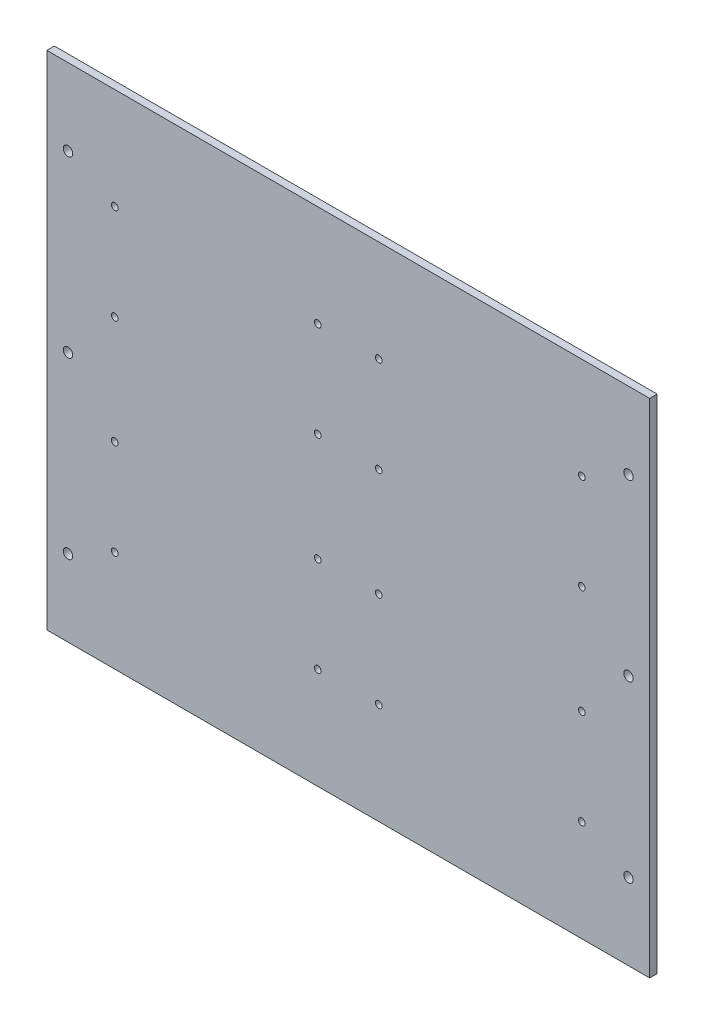
ISO-10303-21;
HEADER;
FILE_DESCRIPTION(('STEP AP214'),'2;1');
FILE_NAME('part.step','',(''),(''),'','','');
FILE_SCHEMA(('AUTOMOTIVE_DESIGN { 1 0 10303 214 1 1 1 1 }'));
ENDSEC;
DATA;
#1=APPLICATION_CONTEXT('core data for automotive mechanical design processes');
#2=APPLICATION_PROTOCOL_DEFINITION('international standard','automotive_design',2000,#1);
#3=PRODUCT_CONTEXT('',#1,'mechanical');
#4=PRODUCT('Part','Part','',(#3));
#5=PRODUCT_RELATED_PRODUCT_CATEGORY('part','',(#4));
#6=PRODUCT_DEFINITION_FORMATION('','',#4);
#7=PRODUCT_DEFINITION_CONTEXT('part definition',#1,'design');
#8=PRODUCT_DEFINITION('design','',#6,#7);
#9=PRODUCT_DEFINITION_SHAPE('','',#8);
#10=(LENGTH_UNIT() NAMED_UNIT(*) SI_UNIT(.MILLI.,.METRE.));
#11=(NAMED_UNIT(*) PLANE_ANGLE_UNIT() SI_UNIT($,.RADIAN.));
#12=(NAMED_UNIT(*) SI_UNIT($,.STERADIAN.) SOLID_ANGLE_UNIT());
#13=UNCERTAINTY_MEASURE_WITH_UNIT(LENGTH_MEASURE(1.E-05),#10,'distance_accuracy_value','');
#14=(GEOMETRIC_REPRESENTATION_CONTEXT(3) GLOBAL_UNCERTAINTY_ASSIGNED_CONTEXT((#13)) GLOBAL_UNIT_ASSIGNED_CONTEXT((#10,
#11,#12)) REPRESENTATION_CONTEXT('',''));
#15=CARTESIAN_POINT('',(0.,0.,0.));
#16=DIRECTION('',(0.,0.,1.));
#17=DIRECTION('',(1.,0.,0.));
#18=AXIS2_PLACEMENT_3D('',#15,#16,#17);
#19=CARTESIAN_POINT('',(100.75,0.,3.));
#20=DIRECTION('',(0.,1.,0.));
#21=DIRECTION('',(0.,0.,1.));
#22=AXIS2_PLACEMENT_3D('',#19,#20,#21);
#23=PLANE('',#22);
#24=DIRECTION('',(1.,0.,0.));
#25=VECTOR('',#24,1.);
#26=CARTESIAN_POINT('',(100.75,0.,0.));
#27=LINE('',#26,#25);
#28=CARTESIAN_POINT('',(100.75,0.,0.));
#29=VERTEX_POINT('',#28);
#30=CARTESIAN_POINT('',(342.75,0.,0.));
#31=VERTEX_POINT('',#30);
#32=EDGE_CURVE('E110',#29,#31,#27,.T.);
#33=ORIENTED_EDGE('',*,*,#32,.T.);
#34=DIRECTION('',(0.,0.,-1.));
#35=VECTOR('',#34,1.);
#36=CARTESIAN_POINT('',(342.75,0.,3.));
#37=LINE('',#36,#35);
#38=CARTESIAN_POINT('',(342.75,0.,3.));
#39=VERTEX_POINT('',#38);
#40=EDGE_CURVE('E11',#39,#31,#37,.T.);
#41=ORIENTED_EDGE('',*,*,#40,.F.);
#42=DIRECTION('',(1.,0.,0.));
#43=VECTOR('',#42,1.);
#44=CARTESIAN_POINT('',(100.75,0.,3.));
#45=LINE('',#44,#43);
#46=CARTESIAN_POINT('',(100.75,0.,3.));
#47=VERTEX_POINT('',#46);
#48=EDGE_CURVE('E91',#47,#39,#45,.T.);
#49=ORIENTED_EDGE('',*,*,#48,.F.);
#50=DIRECTION('',(0.,0.,-1.));
#51=VECTOR('',#50,1.);
#52=CARTESIAN_POINT('',(100.75,0.,3.));
#53=LINE('',#52,#51);
#54=EDGE_CURVE('E106',#47,#29,#53,.T.);
#55=ORIENTED_EDGE('',*,*,#54,.T.);
#56=EDGE_LOOP('',(#33,#41,#49,#55));
#57=FACE_BOUND('',#56,.T.);
#58=ADVANCED_FACE('F38',(#57),#23,.F.);
#59=CARTESIAN_POINT('',(342.75,201.5,3.));
#60=DIRECTION('',(-1.,0.,0.));
#61=DIRECTION('',(0.,0.,-1.));
#62=AXIS2_PLACEMENT_3D('',#59,#60,#61);
#63=PLANE('',#62);
#64=DIRECTION('',(0.,1.,0.));
#65=VECTOR('',#64,1.);
#66=CARTESIAN_POINT('',(342.75,201.5,0.));
#67=LINE('',#66,#65);
#68=CARTESIAN_POINT('',(342.75,201.5,0.));
#69=VERTEX_POINT('',#68);
#70=EDGE_CURVE('E96',#31,#69,#67,.T.);
#71=ORIENTED_EDGE('',*,*,#70,.T.);
#72=DIRECTION('',(0.,0.,-1.));
#73=VECTOR('',#72,1.);
#74=CARTESIAN_POINT('',(342.75,201.5,3.));
#75=LINE('',#74,#73);
#76=CARTESIAN_POINT('',(342.75,201.5,3.));
#77=VERTEX_POINT('',#76);
#78=EDGE_CURVE('E47',#77,#69,#75,.T.);
#79=ORIENTED_EDGE('',*,*,#78,.F.);
#80=DIRECTION('',(0.,1.,0.));
#81=VECTOR('',#80,1.);
#82=CARTESIAN_POINT('',(342.75,201.5,3.));
#83=LINE('',#82,#81);
#84=EDGE_CURVE('E86',#39,#77,#83,.T.);
#85=ORIENTED_EDGE('',*,*,#84,.F.);
#86=ORIENTED_EDGE('',*,*,#40,.T.);
#87=EDGE_LOOP('',(#71,#79,#85,#86));
#88=FACE_BOUND('',#87,.T.);
#89=ADVANCED_FACE('F95',(#88),#63,.F.);
#90=CARTESIAN_POINT('',(100.75,201.5,3.));
#91=DIRECTION('',(0.,-1.,0.));
#92=DIRECTION('',(0.,0.,-1.));
#93=AXIS2_PLACEMENT_3D('',#90,#91,#92);
#94=PLANE('',#93);
#95=DIRECTION('',(-1.,0.,0.));
#96=VECTOR('',#95,1.);
#97=CARTESIAN_POINT('',(100.75,201.5,0.));
#98=LINE('',#97,#96);
#99=CARTESIAN_POINT('',(100.75,201.5,0.));
#100=VERTEX_POINT('',#99);
#101=EDGE_CURVE('E73',#69,#100,#98,.T.);
#102=ORIENTED_EDGE('',*,*,#101,.T.);
#103=DIRECTION('',(0.,0.,-1.));
#104=VECTOR('',#103,1.);
#105=CARTESIAN_POINT('',(100.75,201.5,3.));
#106=LINE('',#105,#104);
#107=CARTESIAN_POINT('',(100.75,201.5,3.));
#108=VERTEX_POINT('',#107);
#109=EDGE_CURVE('E97',#108,#100,#106,.T.);
#110=ORIENTED_EDGE('',*,*,#109,.F.);
#111=DIRECTION('',(-1.,0.,0.));
#112=VECTOR('',#111,1.);
#113=CARTESIAN_POINT('',(100.75,201.5,3.));
#114=LINE('',#113,#112);
#115=EDGE_CURVE('E89',#77,#108,#114,.T.);
#116=ORIENTED_EDGE('',*,*,#115,.F.);
#117=ORIENTED_EDGE('',*,*,#78,.T.);
#118=EDGE_LOOP('',(#102,#110,#116,#117));
#119=FACE_BOUND('',#118,.T.);
#120=ADVANCED_FACE('F99',(#119),#94,.F.);
#121=CARTESIAN_POINT('',(100.75,201.5,3.));
#122=DIRECTION('',(1.,0.,0.));
#123=DIRECTION('',(0.,0.,1.));
#124=AXIS2_PLACEMENT_3D('',#121,#122,#123);
#125=PLANE('',#124);
#126=DIRECTION('',(0.,-1.,0.));
#127=VECTOR('',#126,1.);
#128=CARTESIAN_POINT('',(100.75,201.5,0.));
#129=LINE('',#128,#127);
#130=EDGE_CURVE('E79',#100,#29,#129,.T.);
#131=ORIENTED_EDGE('',*,*,#130,.T.);
#132=ORIENTED_EDGE('',*,*,#54,.F.);
#133=DIRECTION('',(0.,-1.,0.));
#134=VECTOR('',#133,1.);
#135=CARTESIAN_POINT('',(100.75,201.5,3.));
#136=LINE('',#135,#134);
#137=EDGE_CURVE('E56',#108,#47,#136,.T.);
#138=ORIENTED_EDGE('',*,*,#137,.F.);
#139=ORIENTED_EDGE('',*,*,#109,.T.);
#140=EDGE_LOOP('',(#131,#132,#138,#139));
#141=FACE_BOUND('',#140,.T.);
#142=ADVANCED_FACE('F240',(#141),#125,.F.);
#143=CARTESIAN_POINT('',(221.75,100.75,3.));
#144=DIRECTION('',(0.,0.,-1.));
#145=DIRECTION('',(0.,1.,0.));
#146=AXIS2_PLACEMENT_3D('',#143,#144,#145);
#147=PLANE('',#146);
#148=CARTESIAN_POINT('',(109.25,170.75,3.));
#149=DIRECTION('',(0.,0.,1.));
#150=DIRECTION('',(1.,0.,0.));
#151=AXIS2_PLACEMENT_3D('',#148,#149,#150);
#152=CIRCLE('',#151,1.89864999999999);
#153=CARTESIAN_POINT('',(111.14865,170.75,3.));
#154=VERTEX_POINT('',#153);
#155=EDGE_CURVE('E507',#154,#154,#152,.T.);
#156=ORIENTED_EDGE('',*,*,#155,.F.);
#157=EDGE_LOOP('',(#156));
#158=FACE_BOUND('',#157,.T.);
#159=CARTESIAN_POINT('',(109.25,100.75,3.));
#160=DIRECTION('',(0.,0.,1.));
#161=DIRECTION('',(1.,0.,0.));
#162=AXIS2_PLACEMENT_3D('',#159,#160,#161);
#163=CIRCLE('',#162,1.89864999999999);
#164=CARTESIAN_POINT('',(111.14865,100.75,3.));
#165=VERTEX_POINT('',#164);
#166=EDGE_CURVE('E509',#165,#165,#163,.T.);
#167=ORIENTED_EDGE('',*,*,#166,.F.);
#168=EDGE_LOOP('',(#167));
#169=FACE_BOUND('',#168,.T.);
#170=CARTESIAN_POINT('',(109.25,30.7500000000001,3.));
#171=DIRECTION('',(0.,0.,1.));
#172=DIRECTION('',(1.,0.,0.));
#173=AXIS2_PLACEMENT_3D('',#170,#171,#172);
#174=CIRCLE('',#173,1.89864999999999);
#175=CARTESIAN_POINT('',(111.14865,30.7500000000001,3.));
#176=VERTEX_POINT('',#175);
#177=EDGE_CURVE('E517',#176,#176,#174,.T.);
#178=ORIENTED_EDGE('',*,*,#177,.F.);
#179=EDGE_LOOP('',(#178));
#180=FACE_BOUND('',#179,.T.);
#181=CARTESIAN_POINT('',(334.25,30.7500000000001,3.));
#182=DIRECTION('',(0.,0.,1.));
#183=DIRECTION('',(1.,0.,0.));
#184=AXIS2_PLACEMENT_3D('',#181,#182,#183);
#185=CIRCLE('',#184,1.89865);
#186=CARTESIAN_POINT('',(336.14865,30.7500000000001,3.));
#187=VERTEX_POINT('',#186);
#188=EDGE_CURVE('E523',#187,#187,#185,.T.);
#189=ORIENTED_EDGE('',*,*,#188,.F.);
#190=EDGE_LOOP('',(#189));
#191=FACE_BOUND('',#190,.T.);
#192=CARTESIAN_POINT('',(334.25,100.75,3.));
#193=DIRECTION('',(0.,0.,1.));
#194=DIRECTION('',(1.,0.,0.));
#195=AXIS2_PLACEMENT_3D('',#192,#193,#194);
#196=CIRCLE('',#195,1.89865);
#197=CARTESIAN_POINT('',(336.14865,100.75,3.));
#198=VERTEX_POINT('',#197);
#199=EDGE_CURVE('E529',#198,#198,#196,.T.);
#200=ORIENTED_EDGE('',*,*,#199,.F.);
#201=EDGE_LOOP('',(#200));
#202=FACE_BOUND('',#201,.T.);
#203=CARTESIAN_POINT('',(334.25,170.75,3.));
#204=DIRECTION('',(0.,0.,1.));
#205=DIRECTION('',(1.,0.,0.));
#206=AXIS2_PLACEMENT_3D('',#203,#204,#205);
#207=CIRCLE('',#206,1.89865);
#208=CARTESIAN_POINT('',(336.14865,170.75,3.));
#209=VERTEX_POINT('',#208);
#210=EDGE_CURVE('E535',#209,#209,#207,.T.);
#211=ORIENTED_EDGE('',*,*,#210,.F.);
#212=EDGE_LOOP('',(#211));
#213=FACE_BOUND('',#212,.T.);
#214=CARTESIAN_POINT('',(128.,40.675,3.));
#215=DIRECTION('',(0.,0.,1.));
#216=DIRECTION('',(1.,0.,0.));
#217=AXIS2_PLACEMENT_3D('',#214,#215,#216);
#218=CIRCLE('',#217,1.35255000000001);
#219=CARTESIAN_POINT('',(129.35255,40.675,3.));
#220=VERTEX_POINT('',#219);
#221=EDGE_CURVE('E171',#220,#220,#218,.T.);
#222=ORIENTED_EDGE('',*,*,#221,.F.);
#223=EDGE_LOOP('',(#222));
#224=FACE_BOUND('',#223,.T.);
#225=CARTESIAN_POINT('',(128.,79.075,3.));
#226=DIRECTION('',(0.,0.,1.));
#227=DIRECTION('',(1.,0.,0.));
#228=AXIS2_PLACEMENT_3D('',#225,#226,#227);
#229=CIRCLE('',#228,1.35255000000001);
#230=CARTESIAN_POINT('',(129.35255,79.075,3.));
#231=VERTEX_POINT('',#230);
#232=EDGE_CURVE('E160',#231,#231,#229,.T.);
#233=ORIENTED_EDGE('',*,*,#232,.F.);
#234=EDGE_LOOP('',(#233));
#235=FACE_BOUND('',#234,.T.);
#236=CARTESIAN_POINT('',(128.,122.425,3.));
#237=DIRECTION('',(0.,0.,1.));
#238=DIRECTION('',(1.,0.,0.));
#239=AXIS2_PLACEMENT_3D('',#236,#237,#238);
#240=CIRCLE('',#239,1.35255000000001);
#241=CARTESIAN_POINT('',(129.35255,122.425,3.));
#242=VERTEX_POINT('',#241);
#243=EDGE_CURVE('E159',#242,#242,#240,.T.);
#244=ORIENTED_EDGE('',*,*,#243,.F.);
#245=EDGE_LOOP('',(#244));
#246=FACE_BOUND('',#245,.T.);
#247=CARTESIAN_POINT('',(128.,160.825,3.));
#248=DIRECTION('',(0.,0.,1.));
#249=DIRECTION('',(1.,0.,0.));
#250=AXIS2_PLACEMENT_3D('',#247,#248,#249);
#251=CIRCLE('',#250,1.35255000000001);
#252=CARTESIAN_POINT('',(129.35255,160.825,3.));
#253=VERTEX_POINT('',#252);
#254=EDGE_CURVE('E177',#253,#253,#251,.T.);
#255=ORIENTED_EDGE('',*,*,#254,.F.);
#256=EDGE_LOOP('',(#255));
#257=FACE_BOUND('',#256,.T.);
#258=CARTESIAN_POINT('',(209.5,160.825,3.));
#259=DIRECTION('',(0.,0.,1.));
#260=DIRECTION('',(1.,0.,0.));
#261=AXIS2_PLACEMENT_3D('',#258,#259,#260);
#262=CIRCLE('',#261,1.35255000000001);
#263=CARTESIAN_POINT('',(210.85255,160.825,3.));
#264=VERTEX_POINT('',#263);
#265=EDGE_CURVE('E183',#264,#264,#262,.T.);
#266=ORIENTED_EDGE('',*,*,#265,.F.);
#267=EDGE_LOOP('',(#266));
#268=FACE_BOUND('',#267,.T.);
#269=CARTESIAN_POINT('',(209.5,122.425,3.));
#270=DIRECTION('',(0.,0.,1.));
#271=DIRECTION('',(1.,0.,0.));
#272=AXIS2_PLACEMENT_3D('',#269,#270,#271);
#273=CIRCLE('',#272,1.35255000000001);
#274=CARTESIAN_POINT('',(210.85255,122.425,3.));
#275=VERTEX_POINT('',#274);
#276=EDGE_CURVE('E189',#275,#275,#273,.T.);
#277=ORIENTED_EDGE('',*,*,#276,.F.);
#278=EDGE_LOOP('',(#277));
#279=FACE_BOUND('',#278,.T.);
#280=CARTESIAN_POINT('',(209.5,79.075,3.));
#281=DIRECTION('',(0.,0.,1.));
#282=DIRECTION('',(1.,0.,0.));
#283=AXIS2_PLACEMENT_3D('',#280,#281,#282);
#284=CIRCLE('',#283,1.35255000000001);
#285=CARTESIAN_POINT('',(210.85255,79.075,3.));
#286=VERTEX_POINT('',#285);
#287=EDGE_CURVE('E156',#286,#286,#284,.T.);
#288=ORIENTED_EDGE('',*,*,#287,.F.);
#289=EDGE_LOOP('',(#288));
#290=FACE_BOUND('',#289,.T.);
#291=CARTESIAN_POINT('',(209.5,40.675,3.));
#292=DIRECTION('',(0.,0.,1.));
#293=DIRECTION('',(1.,0.,0.));
#294=AXIS2_PLACEMENT_3D('',#291,#292,#293);
#295=CIRCLE('',#294,1.35255000000001);
#296=CARTESIAN_POINT('',(210.85255,40.675,3.));
#297=VERTEX_POINT('',#296);
#298=EDGE_CURVE('E153',#297,#297,#295,.T.);
#299=ORIENTED_EDGE('',*,*,#298,.F.);
#300=EDGE_LOOP('',(#299));
#301=FACE_BOUND('',#300,.T.);
#302=CARTESIAN_POINT('',(234.,40.675,3.));
#303=DIRECTION('',(0.,0.,1.));
#304=DIRECTION('',(1.,0.,0.));
#305=AXIS2_PLACEMENT_3D('',#302,#303,#304);
#306=CIRCLE('',#305,1.35255000000001);
#307=CARTESIAN_POINT('',(235.35255,40.675,3.));
#308=VERTEX_POINT('',#307);
#309=EDGE_CURVE('E149',#308,#308,#306,.T.);
#310=ORIENTED_EDGE('',*,*,#309,.F.);
#311=EDGE_LOOP('',(#310));
#312=FACE_BOUND('',#311,.T.);
#313=CARTESIAN_POINT('',(234.,79.075,3.));
#314=DIRECTION('',(0.,0.,1.));
#315=DIRECTION('',(1.,0.,0.));
#316=AXIS2_PLACEMENT_3D('',#313,#314,#315);
#317=CIRCLE('',#316,1.35255000000001);
#318=CARTESIAN_POINT('',(235.35255,79.075,3.));
#319=VERTEX_POINT('',#318);
#320=EDGE_CURVE('E145',#319,#319,#317,.T.);
#321=ORIENTED_EDGE('',*,*,#320,.F.);
#322=EDGE_LOOP('',(#321));
#323=FACE_BOUND('',#322,.T.);
#324=CARTESIAN_POINT('',(234.,122.425,3.));
#325=DIRECTION('',(0.,0.,1.));
#326=DIRECTION('',(1.,0.,0.));
#327=AXIS2_PLACEMENT_3D('',#324,#325,#326);
#328=CIRCLE('',#327,1.35255000000001);
#329=CARTESIAN_POINT('',(235.35255,122.425,3.));
#330=VERTEX_POINT('',#329);
#331=EDGE_CURVE('E141',#330,#330,#328,.T.);
#332=ORIENTED_EDGE('',*,*,#331,.F.);
#333=EDGE_LOOP('',(#332));
#334=FACE_BOUND('',#333,.T.);
#335=CARTESIAN_POINT('',(234.,160.825,3.));
#336=DIRECTION('',(0.,0.,1.));
#337=DIRECTION('',(1.,0.,0.));
#338=AXIS2_PLACEMENT_3D('',#335,#336,#337);
#339=CIRCLE('',#338,1.35255000000001);
#340=CARTESIAN_POINT('',(235.35255,160.825,3.));
#341=VERTEX_POINT('',#340);
#342=EDGE_CURVE('E137',#341,#341,#339,.T.);
#343=ORIENTED_EDGE('',*,*,#342,.F.);
#344=EDGE_LOOP('',(#343));
#345=FACE_BOUND('',#344,.T.);
#346=CARTESIAN_POINT('',(315.5,160.825,3.));
#347=DIRECTION('',(0.,0.,1.));
#348=DIRECTION('',(1.,0.,0.));
#349=AXIS2_PLACEMENT_3D('',#346,#347,#348);
#350=CIRCLE('',#349,1.35255000000001);
#351=CARTESIAN_POINT('',(316.85255,160.825,3.));
#352=VERTEX_POINT('',#351);
#353=EDGE_CURVE('E133',#352,#352,#350,.T.);
#354=ORIENTED_EDGE('',*,*,#353,.F.);
#355=EDGE_LOOP('',(#354));
#356=FACE_BOUND('',#355,.T.);
#357=CARTESIAN_POINT('',(315.5,122.425,3.));
#358=DIRECTION('',(0.,0.,1.));
#359=DIRECTION('',(1.,0.,0.));
#360=AXIS2_PLACEMENT_3D('',#357,#358,#359);
#361=CIRCLE('',#360,1.35255000000001);
#362=CARTESIAN_POINT('',(316.85255,122.425,3.));
#363=VERTEX_POINT('',#362);
#364=EDGE_CURVE('E129',#363,#363,#361,.T.);
#365=ORIENTED_EDGE('',*,*,#364,.F.);
#366=EDGE_LOOP('',(#365));
#367=FACE_BOUND('',#366,.T.);
#368=CARTESIAN_POINT('',(315.5,79.075,3.));
#369=DIRECTION('',(0.,0.,1.));
#370=DIRECTION('',(1.,0.,0.));
#371=AXIS2_PLACEMENT_3D('',#368,#369,#370);
#372=CIRCLE('',#371,1.35255000000001);
#373=CARTESIAN_POINT('',(316.85255,79.075,3.));
#374=VERTEX_POINT('',#373);
#375=EDGE_CURVE('E125',#374,#374,#372,.T.);
#376=ORIENTED_EDGE('',*,*,#375,.F.);
#377=EDGE_LOOP('',(#376));
#378=FACE_BOUND('',#377,.T.);
#379=CARTESIAN_POINT('',(315.5,40.675,3.));
#380=DIRECTION('',(0.,0.,1.));
#381=DIRECTION('',(1.,0.,0.));
#382=AXIS2_PLACEMENT_3D('',#379,#380,#381);
#383=CIRCLE('',#382,1.35255000000001);
#384=CARTESIAN_POINT('',(316.85255,40.675,3.));
#385=VERTEX_POINT('',#384);
#386=EDGE_CURVE('E124',#385,#385,#383,.T.);
#387=ORIENTED_EDGE('',*,*,#386,.F.);
#388=EDGE_LOOP('',(#387));
#389=FACE_BOUND('',#388,.T.);
#390=ORIENTED_EDGE('',*,*,#48,.T.);
#391=ORIENTED_EDGE('',*,*,#84,.T.);
#392=ORIENTED_EDGE('',*,*,#115,.T.);
#393=ORIENTED_EDGE('',*,*,#137,.T.);
#394=EDGE_LOOP('',(#390,#391,#392,#393));
#395=FACE_BOUND('',#394,.T.);
#396=ADVANCED_FACE('F87',(#158,#169,#180,#191,#202,#213,#224,#235,#246,#257,#268,#279,#290,#301,
#312,#323,#334,#345,#356,#367,#378,#389,#395),#147,.F.);
#397=CARTESIAN_POINT('',(221.75,100.75,0.));
#398=DIRECTION('',(0.,0.,-1.));
#399=DIRECTION('',(0.,1.,0.));
#400=AXIS2_PLACEMENT_3D('',#397,#398,#399);
#401=PLANE('',#400);
#402=CARTESIAN_POINT('',(109.25,170.75,0.));
#403=DIRECTION('',(0.,0.,1.));
#404=DIRECTION('',(1.,0.,0.));
#405=AXIS2_PLACEMENT_3D('',#402,#403,#404);
#406=CIRCLE('',#405,1.89865);
#407=CARTESIAN_POINT('',(111.14865,170.75,0.));
#408=VERTEX_POINT('',#407);
#409=EDGE_CURVE('E504',#408,#408,#406,.T.);
#410=ORIENTED_EDGE('',*,*,#409,.T.);
#411=EDGE_LOOP('',(#410));
#412=FACE_BOUND('',#411,.T.);
#413=CARTESIAN_POINT('',(109.25,100.75,0.));
#414=DIRECTION('',(0.,0.,1.));
#415=DIRECTION('',(1.,0.,0.));
#416=AXIS2_PLACEMENT_3D('',#413,#414,#415);
#417=CIRCLE('',#416,1.89865);
#418=CARTESIAN_POINT('',(111.14865,100.75,0.));
#419=VERTEX_POINT('',#418);
#420=EDGE_CURVE('E514',#419,#419,#417,.T.);
#421=ORIENTED_EDGE('',*,*,#420,.T.);
#422=EDGE_LOOP('',(#421));
#423=FACE_BOUND('',#422,.T.);
#424=CARTESIAN_POINT('',(109.25,30.7500000000001,0.));
#425=DIRECTION('',(0.,0.,1.));
#426=DIRECTION('',(1.,0.,0.));
#427=AXIS2_PLACEMENT_3D('',#424,#425,#426);
#428=CIRCLE('',#427,1.89865);
#429=CARTESIAN_POINT('',(111.14865,30.7500000000001,0.));
#430=VERTEX_POINT('',#429);
#431=EDGE_CURVE('E520',#430,#430,#428,.T.);
#432=ORIENTED_EDGE('',*,*,#431,.T.);
#433=EDGE_LOOP('',(#432));
#434=FACE_BOUND('',#433,.T.);
#435=CARTESIAN_POINT('',(334.25,30.7500000000001,0.));
#436=DIRECTION('',(0.,0.,1.));
#437=DIRECTION('',(1.,0.,0.));
#438=AXIS2_PLACEMENT_3D('',#435,#436,#437);
#439=CIRCLE('',#438,1.89865);
#440=CARTESIAN_POINT('',(336.14865,30.7500000000001,0.));
#441=VERTEX_POINT('',#440);
#442=EDGE_CURVE('E526',#441,#441,#439,.T.);
#443=ORIENTED_EDGE('',*,*,#442,.T.);
#444=EDGE_LOOP('',(#443));
#445=FACE_BOUND('',#444,.T.);
#446=CARTESIAN_POINT('',(334.25,100.75,0.));
#447=DIRECTION('',(0.,0.,1.));
#448=DIRECTION('',(1.,0.,0.));
#449=AXIS2_PLACEMENT_3D('',#446,#447,#448);
#450=CIRCLE('',#449,1.89865);
#451=CARTESIAN_POINT('',(336.14865,100.75,0.));
#452=VERTEX_POINT('',#451);
#453=EDGE_CURVE('E532',#452,#452,#450,.T.);
#454=ORIENTED_EDGE('',*,*,#453,.T.);
#455=EDGE_LOOP('',(#454));
#456=FACE_BOUND('',#455,.T.);
#457=CARTESIAN_POINT('',(334.25,170.75,0.));
#458=DIRECTION('',(0.,0.,1.));
#459=DIRECTION('',(1.,0.,0.));
#460=AXIS2_PLACEMENT_3D('',#457,#458,#459);
#461=CIRCLE('',#460,1.89865);
#462=CARTESIAN_POINT('',(336.14865,170.75,0.));
#463=VERTEX_POINT('',#462);
#464=EDGE_CURVE('E537',#463,#463,#461,.T.);
#465=ORIENTED_EDGE('',*,*,#464,.T.);
#466=EDGE_LOOP('',(#465));
#467=FACE_BOUND('',#466,.T.);
#468=CARTESIAN_POINT('',(128.,40.675,0.));
#469=DIRECTION('',(0.,0.,-1.));
#470=DIRECTION('',(-1.,0.,0.));
#471=AXIS2_PLACEMENT_3D('',#468,#469,#470);
#472=CIRCLE('',#471,1.35255000000001);
#473=CARTESIAN_POINT('',(126.64745,40.675,0.));
#474=VERTEX_POINT('',#473);
#475=EDGE_CURVE('E41',#474,#474,#472,.T.);
#476=ORIENTED_EDGE('',*,*,#475,.F.);
#477=EDGE_LOOP('',(#476));
#478=FACE_BOUND('',#477,.T.);
#479=CARTESIAN_POINT('',(128.,79.075,0.));
#480=DIRECTION('',(0.,0.,-1.));
#481=DIRECTION('',(-1.,0.,0.));
#482=AXIS2_PLACEMENT_3D('',#479,#480,#481);
#483=CIRCLE('',#482,1.35255000000001);
#484=CARTESIAN_POINT('',(126.64745,79.075,0.));
#485=VERTEX_POINT('',#484);
#486=EDGE_CURVE('E157',#485,#485,#483,.T.);
#487=ORIENTED_EDGE('',*,*,#486,.F.);
#488=EDGE_LOOP('',(#487));
#489=FACE_BOUND('',#488,.T.);
#490=CARTESIAN_POINT('',(128.,122.425,0.));
#491=DIRECTION('',(0.,0.,-1.));
#492=DIRECTION('',(-1.,0.,0.));
#493=AXIS2_PLACEMENT_3D('',#490,#491,#492);
#494=CIRCLE('',#493,1.35255000000001);
#495=CARTESIAN_POINT('',(126.64745,122.425,0.));
#496=VERTEX_POINT('',#495);
#497=EDGE_CURVE('E164',#496,#496,#494,.T.);
#498=ORIENTED_EDGE('',*,*,#497,.F.);
#499=EDGE_LOOP('',(#498));
#500=FACE_BOUND('',#499,.T.);
#501=CARTESIAN_POINT('',(128.,160.825,0.));
#502=DIRECTION('',(0.,0.,-1.));
#503=DIRECTION('',(-1.,0.,0.));
#504=AXIS2_PLACEMENT_3D('',#501,#502,#503);
#505=CIRCLE('',#504,1.35255000000001);
#506=CARTESIAN_POINT('',(126.64745,160.825,0.));
#507=VERTEX_POINT('',#506);
#508=EDGE_CURVE('E180',#507,#507,#505,.T.);
#509=ORIENTED_EDGE('',*,*,#508,.F.);
#510=EDGE_LOOP('',(#509));
#511=FACE_BOUND('',#510,.T.);
#512=CARTESIAN_POINT('',(209.5,160.825,0.));
#513=DIRECTION('',(0.,0.,-1.));
#514=DIRECTION('',(-1.,0.,0.));
#515=AXIS2_PLACEMENT_3D('',#512,#513,#514);
#516=CIRCLE('',#515,1.35255000000001);
#517=CARTESIAN_POINT('',(208.14745,160.825,0.));
#518=VERTEX_POINT('',#517);
#519=EDGE_CURVE('E186',#518,#518,#516,.T.);
#520=ORIENTED_EDGE('',*,*,#519,.F.);
#521=EDGE_LOOP('',(#520));
#522=FACE_BOUND('',#521,.T.);
#523=CARTESIAN_POINT('',(209.5,122.425,0.));
#524=DIRECTION('',(0.,0.,-1.));
#525=DIRECTION('',(-1.,0.,0.));
#526=AXIS2_PLACEMENT_3D('',#523,#524,#525);
#527=CIRCLE('',#526,1.35255000000001);
#528=CARTESIAN_POINT('',(208.14745,122.425,0.));
#529=VERTEX_POINT('',#528);
#530=EDGE_CURVE('E192',#529,#529,#527,.T.);
#531=ORIENTED_EDGE('',*,*,#530,.F.);
#532=EDGE_LOOP('',(#531));
#533=FACE_BOUND('',#532,.T.);
#534=CARTESIAN_POINT('',(209.5,79.075,0.));
#535=DIRECTION('',(0.,0.,-1.));
#536=DIRECTION('',(-1.,0.,0.));
#537=AXIS2_PLACEMENT_3D('',#534,#535,#536);
#538=CIRCLE('',#537,1.35255000000001);
#539=CARTESIAN_POINT('',(208.14745,79.075,0.));
#540=VERTEX_POINT('',#539);
#541=EDGE_CURVE('E154',#540,#540,#538,.T.);
#542=ORIENTED_EDGE('',*,*,#541,.F.);
#543=EDGE_LOOP('',(#542));
#544=FACE_BOUND('',#543,.T.);
#545=CARTESIAN_POINT('',(209.5,40.675,0.));
#546=DIRECTION('',(0.,0.,-1.));
#547=DIRECTION('',(-1.,0.,0.));
#548=AXIS2_PLACEMENT_3D('',#545,#546,#547);
#549=CIRCLE('',#548,1.35255000000001);
#550=CARTESIAN_POINT('',(208.14745,40.675,0.));
#551=VERTEX_POINT('',#550);
#552=EDGE_CURVE('E150',#551,#551,#549,.T.);
#553=ORIENTED_EDGE('',*,*,#552,.F.);
#554=EDGE_LOOP('',(#553));
#555=FACE_BOUND('',#554,.T.);
#556=CARTESIAN_POINT('',(234.,40.675,0.));
#557=DIRECTION('',(0.,0.,-1.));
#558=DIRECTION('',(-1.,0.,0.));
#559=AXIS2_PLACEMENT_3D('',#556,#557,#558);
#560=CIRCLE('',#559,1.35255000000001);
#561=CARTESIAN_POINT('',(232.64745,40.675,0.));
#562=VERTEX_POINT('',#561);
#563=EDGE_CURVE('E146',#562,#562,#560,.T.);
#564=ORIENTED_EDGE('',*,*,#563,.F.);
#565=EDGE_LOOP('',(#564));
#566=FACE_BOUND('',#565,.T.);
#567=CARTESIAN_POINT('',(234.,79.075,0.));
#568=DIRECTION('',(0.,0.,-1.));
#569=DIRECTION('',(-1.,0.,0.));
#570=AXIS2_PLACEMENT_3D('',#567,#568,#569);
#571=CIRCLE('',#570,1.35255000000001);
#572=CARTESIAN_POINT('',(232.64745,79.075,0.));
#573=VERTEX_POINT('',#572);
#574=EDGE_CURVE('E142',#573,#573,#571,.T.);
#575=ORIENTED_EDGE('',*,*,#574,.F.);
#576=EDGE_LOOP('',(#575));
#577=FACE_BOUND('',#576,.T.);
#578=CARTESIAN_POINT('',(234.,122.425,0.));
#579=DIRECTION('',(0.,0.,-1.));
#580=DIRECTION('',(-1.,0.,0.));
#581=AXIS2_PLACEMENT_3D('',#578,#579,#580);
#582=CIRCLE('',#581,1.35255000000001);
#583=CARTESIAN_POINT('',(232.64745,122.425,0.));
#584=VERTEX_POINT('',#583);
#585=EDGE_CURVE('E138',#584,#584,#582,.T.);
#586=ORIENTED_EDGE('',*,*,#585,.F.);
#587=EDGE_LOOP('',(#586));
#588=FACE_BOUND('',#587,.T.);
#589=CARTESIAN_POINT('',(234.,160.825,0.));
#590=DIRECTION('',(0.,0.,-1.));
#591=DIRECTION('',(-1.,0.,0.));
#592=AXIS2_PLACEMENT_3D('',#589,#590,#591);
#593=CIRCLE('',#592,1.35255000000001);
#594=CARTESIAN_POINT('',(232.64745,160.825,0.));
#595=VERTEX_POINT('',#594);
#596=EDGE_CURVE('E134',#595,#595,#593,.T.);
#597=ORIENTED_EDGE('',*,*,#596,.F.);
#598=EDGE_LOOP('',(#597));
#599=FACE_BOUND('',#598,.T.);
#600=CARTESIAN_POINT('',(315.5,160.825,0.));
#601=DIRECTION('',(0.,0.,-1.));
#602=DIRECTION('',(-1.,0.,0.));
#603=AXIS2_PLACEMENT_3D('',#600,#601,#602);
#604=CIRCLE('',#603,1.35255000000001);
#605=CARTESIAN_POINT('',(314.14745,160.825,0.));
#606=VERTEX_POINT('',#605);
#607=EDGE_CURVE('E130',#606,#606,#604,.T.);
#608=ORIENTED_EDGE('',*,*,#607,.F.);
#609=EDGE_LOOP('',(#608));
#610=FACE_BOUND('',#609,.T.);
#611=CARTESIAN_POINT('',(315.5,122.425,0.));
#612=DIRECTION('',(0.,0.,-1.));
#613=DIRECTION('',(-1.,0.,0.));
#614=AXIS2_PLACEMENT_3D('',#611,#612,#613);
#615=CIRCLE('',#614,1.35255000000001);
#616=CARTESIAN_POINT('',(314.14745,122.425,0.));
#617=VERTEX_POINT('',#616);
#618=EDGE_CURVE('E126',#617,#617,#615,.T.);
#619=ORIENTED_EDGE('',*,*,#618,.F.);
#620=EDGE_LOOP('',(#619));
#621=FACE_BOUND('',#620,.T.);
#622=CARTESIAN_POINT('',(315.5,79.075,0.));
#623=DIRECTION('',(0.,0.,-1.));
#624=DIRECTION('',(-1.,0.,0.));
#625=AXIS2_PLACEMENT_3D('',#622,#623,#624);
#626=CIRCLE('',#625,1.35255000000001);
#627=CARTESIAN_POINT('',(314.14745,79.075,0.));
#628=VERTEX_POINT('',#627);
#629=EDGE_CURVE('E121',#628,#628,#626,.T.);
#630=ORIENTED_EDGE('',*,*,#629,.F.);
#631=EDGE_LOOP('',(#630));
#632=FACE_BOUND('',#631,.T.);
#633=CARTESIAN_POINT('',(315.5,40.675,0.));
#634=DIRECTION('',(0.,0.,-1.));
#635=DIRECTION('',(-1.,0.,0.));
#636=AXIS2_PLACEMENT_3D('',#633,#634,#635);
#637=CIRCLE('',#636,1.35255000000001);
#638=CARTESIAN_POINT('',(314.14745,40.675,0.));
#639=VERTEX_POINT('',#638);
#640=EDGE_CURVE('E113',#639,#639,#637,.T.);
#641=ORIENTED_EDGE('',*,*,#640,.F.);
#642=EDGE_LOOP('',(#641));
#643=FACE_BOUND('',#642,.T.);
#644=ORIENTED_EDGE('',*,*,#32,.F.);
#645=ORIENTED_EDGE('',*,*,#130,.F.);
#646=ORIENTED_EDGE('',*,*,#101,.F.);
#647=ORIENTED_EDGE('',*,*,#70,.F.);
#648=EDGE_LOOP('',(#644,#645,#646,#647));
#649=FACE_BOUND('',#648,.T.);
#650=ADVANCED_FACE('F267',(#412,#423,#434,#445,#456,#467,#478,#489,#500,#511,#522,#533,#544,
#555,#566,#577,#588,#599,#610,#621,#632,#643,#649),#401,.T.);
#651=CARTESIAN_POINT('',(315.5,40.675,3.));
#652=DIRECTION('',(0.,0.,1.));
#653=DIRECTION('',(1.,0.,0.));
#654=AXIS2_PLACEMENT_3D('',#651,#652,#653);
#655=CYLINDRICAL_SURFACE('',#654,1.35255000000001);
#656=ORIENTED_EDGE('',*,*,#640,.T.);
#657=EDGE_LOOP('',(#656));
#658=FACE_BOUND('',#657,.T.);
#659=ORIENTED_EDGE('',*,*,#386,.T.);
#660=EDGE_LOOP('',(#659));
#661=FACE_BOUND('',#660,.T.);
#662=ADVANCED_FACE('F275',(#658,#661),#655,.F.);
#663=CARTESIAN_POINT('',(315.5,79.075,3.));
#664=DIRECTION('',(0.,0.,1.));
#665=DIRECTION('',(1.,0.,0.));
#666=AXIS2_PLACEMENT_3D('',#663,#664,#665);
#667=CYLINDRICAL_SURFACE('',#666,1.35255000000001);
#668=ORIENTED_EDGE('',*,*,#629,.T.);
#669=EDGE_LOOP('',(#668));
#670=FACE_BOUND('',#669,.T.);
#671=ORIENTED_EDGE('',*,*,#375,.T.);
#672=EDGE_LOOP('',(#671));
#673=FACE_BOUND('',#672,.T.);
#674=ADVANCED_FACE('F282',(#670,#673),#667,.F.);
#675=CARTESIAN_POINT('',(315.5,122.425,3.));
#676=DIRECTION('',(0.,0.,1.));
#677=DIRECTION('',(1.,0.,0.));
#678=AXIS2_PLACEMENT_3D('',#675,#676,#677);
#679=CYLINDRICAL_SURFACE('',#678,1.35255000000001);
#680=ORIENTED_EDGE('',*,*,#618,.T.);
#681=EDGE_LOOP('',(#680));
#682=FACE_BOUND('',#681,.T.);
#683=ORIENTED_EDGE('',*,*,#364,.T.);
#684=EDGE_LOOP('',(#683));
#685=FACE_BOUND('',#684,.T.);
#686=ADVANCED_FACE('F290',(#682,#685),#679,.F.);
#687=CARTESIAN_POINT('',(315.5,160.825,3.));
#688=DIRECTION('',(0.,0.,1.));
#689=DIRECTION('',(1.,0.,0.));
#690=AXIS2_PLACEMENT_3D('',#687,#688,#689);
#691=CYLINDRICAL_SURFACE('',#690,1.35255000000001);
#692=ORIENTED_EDGE('',*,*,#607,.T.);
#693=EDGE_LOOP('',(#692));
#694=FACE_BOUND('',#693,.T.);
#695=ORIENTED_EDGE('',*,*,#353,.T.);
#696=EDGE_LOOP('',(#695));
#697=FACE_BOUND('',#696,.T.);
#698=ADVANCED_FACE('F298',(#694,#697),#691,.F.);
#699=CARTESIAN_POINT('',(234.,160.825,3.));
#700=DIRECTION('',(0.,0.,1.));
#701=DIRECTION('',(1.,0.,0.));
#702=AXIS2_PLACEMENT_3D('',#699,#700,#701);
#703=CYLINDRICAL_SURFACE('',#702,1.35255000000001);
#704=ORIENTED_EDGE('',*,*,#596,.T.);
#705=EDGE_LOOP('',(#704));
#706=FACE_BOUND('',#705,.T.);
#707=ORIENTED_EDGE('',*,*,#342,.T.);
#708=EDGE_LOOP('',(#707));
#709=FACE_BOUND('',#708,.T.);
#710=ADVANCED_FACE('F306',(#706,#709),#703,.F.);
#711=CARTESIAN_POINT('',(234.,122.425,3.));
#712=DIRECTION('',(0.,0.,1.));
#713=DIRECTION('',(1.,0.,0.));
#714=AXIS2_PLACEMENT_3D('',#711,#712,#713);
#715=CYLINDRICAL_SURFACE('',#714,1.35255000000001);
#716=ORIENTED_EDGE('',*,*,#585,.T.);
#717=EDGE_LOOP('',(#716));
#718=FACE_BOUND('',#717,.T.);
#719=ORIENTED_EDGE('',*,*,#331,.T.);
#720=EDGE_LOOP('',(#719));
#721=FACE_BOUND('',#720,.T.);
#722=ADVANCED_FACE('F314',(#718,#721),#715,.F.);
#723=CARTESIAN_POINT('',(234.,79.075,3.));
#724=DIRECTION('',(0.,0.,1.));
#725=DIRECTION('',(1.,0.,0.));
#726=AXIS2_PLACEMENT_3D('',#723,#724,#725);
#727=CYLINDRICAL_SURFACE('',#726,1.35255000000001);
#728=ORIENTED_EDGE('',*,*,#574,.T.);
#729=EDGE_LOOP('',(#728));
#730=FACE_BOUND('',#729,.T.);
#731=ORIENTED_EDGE('',*,*,#320,.T.);
#732=EDGE_LOOP('',(#731));
#733=FACE_BOUND('',#732,.T.);
#734=ADVANCED_FACE('F322',(#730,#733),#727,.F.);
#735=CARTESIAN_POINT('',(234.,40.675,3.));
#736=DIRECTION('',(0.,0.,1.));
#737=DIRECTION('',(1.,0.,0.));
#738=AXIS2_PLACEMENT_3D('',#735,#736,#737);
#739=CYLINDRICAL_SURFACE('',#738,1.35255000000001);
#740=ORIENTED_EDGE('',*,*,#563,.T.);
#741=EDGE_LOOP('',(#740));
#742=FACE_BOUND('',#741,.T.);
#743=ORIENTED_EDGE('',*,*,#309,.T.);
#744=EDGE_LOOP('',(#743));
#745=FACE_BOUND('',#744,.T.);
#746=ADVANCED_FACE('F330',(#742,#745),#739,.F.);
#747=CARTESIAN_POINT('',(209.5,40.675,3.));
#748=DIRECTION('',(0.,0.,1.));
#749=DIRECTION('',(1.,0.,0.));
#750=AXIS2_PLACEMENT_3D('',#747,#748,#749);
#751=CYLINDRICAL_SURFACE('',#750,1.35255000000001);
#752=ORIENTED_EDGE('',*,*,#552,.T.);
#753=EDGE_LOOP('',(#752));
#754=FACE_BOUND('',#753,.T.);
#755=ORIENTED_EDGE('',*,*,#298,.T.);
#756=EDGE_LOOP('',(#755));
#757=FACE_BOUND('',#756,.T.);
#758=ADVANCED_FACE('F338',(#754,#757),#751,.F.);
#759=CARTESIAN_POINT('',(209.5,79.075,3.));
#760=DIRECTION('',(0.,0.,1.));
#761=DIRECTION('',(1.,0.,0.));
#762=AXIS2_PLACEMENT_3D('',#759,#760,#761);
#763=CYLINDRICAL_SURFACE('',#762,1.35255000000001);
#764=ORIENTED_EDGE('',*,*,#541,.T.);
#765=EDGE_LOOP('',(#764));
#766=FACE_BOUND('',#765,.T.);
#767=ORIENTED_EDGE('',*,*,#287,.T.);
#768=EDGE_LOOP('',(#767));
#769=FACE_BOUND('',#768,.T.);
#770=ADVANCED_FACE('F346',(#766,#769),#763,.F.);
#771=CARTESIAN_POINT('',(209.5,122.425,3.));
#772=DIRECTION('',(0.,0.,1.));
#773=DIRECTION('',(1.,0.,0.));
#774=AXIS2_PLACEMENT_3D('',#771,#772,#773);
#775=CYLINDRICAL_SURFACE('',#774,1.35255000000001);
#776=ORIENTED_EDGE('',*,*,#530,.T.);
#777=EDGE_LOOP('',(#776));
#778=FACE_BOUND('',#777,.T.);
#779=ORIENTED_EDGE('',*,*,#276,.T.);
#780=EDGE_LOOP('',(#779));
#781=FACE_BOUND('',#780,.T.);
#782=ADVANCED_FACE('F354',(#778,#781),#775,.F.);
#783=CARTESIAN_POINT('',(209.5,160.825,3.));
#784=DIRECTION('',(0.,0.,1.));
#785=DIRECTION('',(1.,0.,0.));
#786=AXIS2_PLACEMENT_3D('',#783,#784,#785);
#787=CYLINDRICAL_SURFACE('',#786,1.35255000000001);
#788=ORIENTED_EDGE('',*,*,#519,.T.);
#789=EDGE_LOOP('',(#788));
#790=FACE_BOUND('',#789,.T.);
#791=ORIENTED_EDGE('',*,*,#265,.T.);
#792=EDGE_LOOP('',(#791));
#793=FACE_BOUND('',#792,.T.);
#794=ADVANCED_FACE('F362',(#790,#793),#787,.F.);
#795=CARTESIAN_POINT('',(128.,160.825,3.));
#796=DIRECTION('',(0.,0.,1.));
#797=DIRECTION('',(1.,0.,0.));
#798=AXIS2_PLACEMENT_3D('',#795,#796,#797);
#799=CYLINDRICAL_SURFACE('',#798,1.35255000000001);
#800=ORIENTED_EDGE('',*,*,#508,.T.);
#801=EDGE_LOOP('',(#800));
#802=FACE_BOUND('',#801,.T.);
#803=ORIENTED_EDGE('',*,*,#254,.T.);
#804=EDGE_LOOP('',(#803));
#805=FACE_BOUND('',#804,.T.);
#806=ADVANCED_FACE('F370',(#802,#805),#799,.F.);
#807=CARTESIAN_POINT('',(128.,122.425,3.));
#808=DIRECTION('',(0.,0.,1.));
#809=DIRECTION('',(1.,0.,0.));
#810=AXIS2_PLACEMENT_3D('',#807,#808,#809);
#811=CYLINDRICAL_SURFACE('',#810,1.35255000000001);
#812=ORIENTED_EDGE('',*,*,#497,.T.);
#813=EDGE_LOOP('',(#812));
#814=FACE_BOUND('',#813,.T.);
#815=ORIENTED_EDGE('',*,*,#243,.T.);
#816=EDGE_LOOP('',(#815));
#817=FACE_BOUND('',#816,.T.);
#818=ADVANCED_FACE('F378',(#814,#817),#811,.F.);
#819=CARTESIAN_POINT('',(128.,79.075,3.));
#820=DIRECTION('',(0.,0.,1.));
#821=DIRECTION('',(1.,0.,0.));
#822=AXIS2_PLACEMENT_3D('',#819,#820,#821);
#823=CYLINDRICAL_SURFACE('',#822,1.35255000000001);
#824=ORIENTED_EDGE('',*,*,#486,.T.);
#825=EDGE_LOOP('',(#824));
#826=FACE_BOUND('',#825,.T.);
#827=ORIENTED_EDGE('',*,*,#232,.T.);
#828=EDGE_LOOP('',(#827));
#829=FACE_BOUND('',#828,.T.);
#830=ADVANCED_FACE('F386',(#826,#829),#823,.F.);
#831=CARTESIAN_POINT('',(128.,40.675,3.));
#832=DIRECTION('',(0.,0.,1.));
#833=DIRECTION('',(1.,0.,0.));
#834=AXIS2_PLACEMENT_3D('',#831,#832,#833);
#835=CYLINDRICAL_SURFACE('',#834,1.35255000000001);
#836=ORIENTED_EDGE('',*,*,#475,.T.);
#837=EDGE_LOOP('',(#836));
#838=FACE_BOUND('',#837,.T.);
#839=ORIENTED_EDGE('',*,*,#221,.T.);
#840=EDGE_LOOP('',(#839));
#841=FACE_BOUND('',#840,.T.);
#842=ADVANCED_FACE('F394',(#838,#841),#835,.F.);
#843=CARTESIAN_POINT('',(334.25,170.75,3.));
#844=DIRECTION('',(0.,0.,1.));
#845=DIRECTION('',(1.,0.,0.));
#846=AXIS2_PLACEMENT_3D('',#843,#844,#845);
#847=CYLINDRICAL_SURFACE('',#846,1.89865);
#848=ORIENTED_EDGE('',*,*,#464,.F.);
#849=EDGE_LOOP('',(#848));
#850=FACE_BOUND('',#849,.T.);
#851=ORIENTED_EDGE('',*,*,#210,.T.);
#852=EDGE_LOOP('',(#851));
#853=FACE_BOUND('',#852,.T.);
#854=ADVANCED_FACE('F400',(#850,#853),#847,.F.);
#855=CARTESIAN_POINT('',(334.25,100.75,3.));
#856=DIRECTION('',(0.,0.,1.));
#857=DIRECTION('',(1.,0.,0.));
#858=AXIS2_PLACEMENT_3D('',#855,#856,#857);
#859=CYLINDRICAL_SURFACE('',#858,1.89865);
#860=ORIENTED_EDGE('',*,*,#453,.F.);
#861=EDGE_LOOP('',(#860));
#862=FACE_BOUND('',#861,.T.);
#863=ORIENTED_EDGE('',*,*,#199,.T.);
#864=EDGE_LOOP('',(#863));
#865=FACE_BOUND('',#864,.T.);
#866=ADVANCED_FACE('F407',(#862,#865),#859,.F.);
#867=CARTESIAN_POINT('',(334.25,30.7500000000001,3.));
#868=DIRECTION('',(0.,0.,1.));
#869=DIRECTION('',(1.,0.,0.));
#870=AXIS2_PLACEMENT_3D('',#867,#868,#869);
#871=CYLINDRICAL_SURFACE('',#870,1.89865);
#872=ORIENTED_EDGE('',*,*,#442,.F.);
#873=EDGE_LOOP('',(#872));
#874=FACE_BOUND('',#873,.T.);
#875=ORIENTED_EDGE('',*,*,#188,.T.);
#876=EDGE_LOOP('',(#875));
#877=FACE_BOUND('',#876,.T.);
#878=ADVANCED_FACE('F415',(#874,#877),#871,.F.);
#879=CARTESIAN_POINT('',(109.25,30.7500000000001,3.));
#880=DIRECTION('',(0.,0.,1.));
#881=DIRECTION('',(1.,0.,0.));
#882=AXIS2_PLACEMENT_3D('',#879,#880,#881);
#883=CYLINDRICAL_SURFACE('',#882,1.89864999999999);
#884=ORIENTED_EDGE('',*,*,#431,.F.);
#885=EDGE_LOOP('',(#884));
#886=FACE_BOUND('',#885,.T.);
#887=ORIENTED_EDGE('',*,*,#177,.T.);
#888=EDGE_LOOP('',(#887));
#889=FACE_BOUND('',#888,.T.);
#890=ADVANCED_FACE('F423',(#886,#889),#883,.F.);
#891=CARTESIAN_POINT('',(109.25,100.75,3.));
#892=DIRECTION('',(0.,0.,1.));
#893=DIRECTION('',(1.,0.,0.));
#894=AXIS2_PLACEMENT_3D('',#891,#892,#893);
#895=CYLINDRICAL_SURFACE('',#894,1.89864999999999);
#896=ORIENTED_EDGE('',*,*,#420,.F.);
#897=EDGE_LOOP('',(#896));
#898=FACE_BOUND('',#897,.T.);
#899=ORIENTED_EDGE('',*,*,#166,.T.);
#900=EDGE_LOOP('',(#899));
#901=FACE_BOUND('',#900,.T.);
#902=ADVANCED_FACE('F431',(#898,#901),#895,.F.);
#903=CARTESIAN_POINT('',(109.25,170.75,3.));
#904=DIRECTION('',(0.,0.,1.));
#905=DIRECTION('',(1.,0.,0.));
#906=AXIS2_PLACEMENT_3D('',#903,#904,#905);
#907=CYLINDRICAL_SURFACE('',#906,1.89864999999999);
#908=ORIENTED_EDGE('',*,*,#409,.F.);
#909=EDGE_LOOP('',(#908));
#910=FACE_BOUND('',#909,.T.);
#911=ORIENTED_EDGE('',*,*,#155,.T.);
#912=EDGE_LOOP('',(#911));
#913=FACE_BOUND('',#912,.T.);
#914=ADVANCED_FACE('F439',(#910,#913),#907,.F.);
#915=CLOSED_SHELL('',(#58,#89,#120,#142,#396,#650,#662,#674,#686,#698,#710,#722,#734,#746,#758,
#770,#782,#794,#806,#818,#830,#842,#854,#866,#878,#890,#902,#914));
#916=MANIFOLD_SOLID_BREP('B2',#915);
#917=ADVANCED_BREP_SHAPE_REPRESENTATION('',(#18,#916),#14);
#918=SHAPE_DEFINITION_REPRESENTATION(#9,#917);
ENDSEC;
END-ISO-10303-21;
